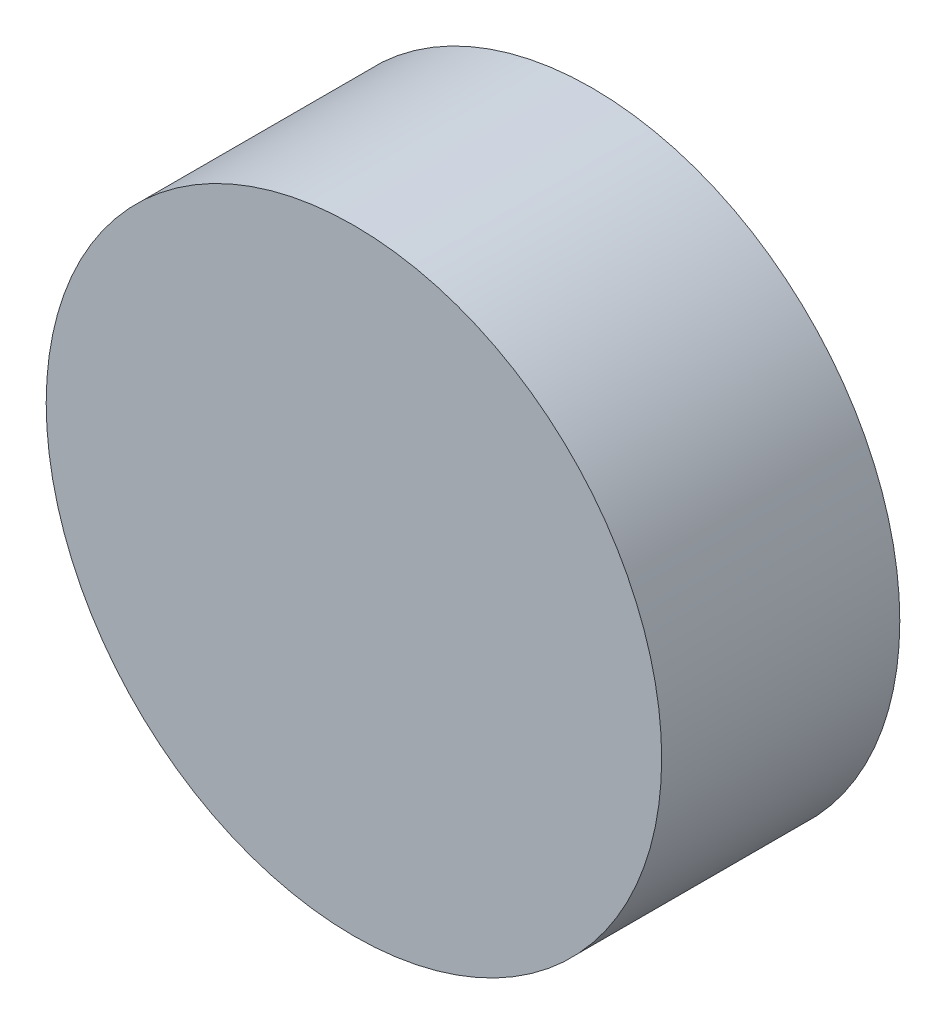
ISO-10303-21;
HEADER;
FILE_DESCRIPTION(('STEP AP214'),'2;1');
FILE_NAME('part.step','',(''),(''),'','','');
FILE_SCHEMA(('AUTOMOTIVE_DESIGN { 1 0 10303 214 1 1 1 1 }'));
ENDSEC;
DATA;
#1=APPLICATION_CONTEXT('core data for automotive mechanical design processes');
#2=APPLICATION_PROTOCOL_DEFINITION('international standard','automotive_design',2000,#1);
#3=PRODUCT_CONTEXT('',#1,'mechanical');
#4=PRODUCT('Part','Part','',(#3));
#5=PRODUCT_RELATED_PRODUCT_CATEGORY('part','',(#4));
#6=PRODUCT_DEFINITION_FORMATION('','',#4);
#7=PRODUCT_DEFINITION_CONTEXT('part definition',#1,'design');
#8=PRODUCT_DEFINITION('design','',#6,#7);
#9=PRODUCT_DEFINITION_SHAPE('','',#8);
#10=(LENGTH_UNIT() NAMED_UNIT(*) SI_UNIT(.MILLI.,.METRE.));
#11=(NAMED_UNIT(*) PLANE_ANGLE_UNIT() SI_UNIT($,.RADIAN.));
#12=(NAMED_UNIT(*) SI_UNIT($,.STERADIAN.) SOLID_ANGLE_UNIT());
#13=UNCERTAINTY_MEASURE_WITH_UNIT(LENGTH_MEASURE(1.E-05),#10,'distance_accuracy_value','');
#14=(GEOMETRIC_REPRESENTATION_CONTEXT(3) GLOBAL_UNCERTAINTY_ASSIGNED_CONTEXT((#13)) GLOBAL_UNIT_ASSIGNED_CONTEXT((#10,
#11,#12)) REPRESENTATION_CONTEXT('',''));
#15=CARTESIAN_POINT('',(0.,0.,0.));
#16=DIRECTION('',(0.,0.,1.));
#17=DIRECTION('',(1.,0.,0.));
#18=AXIS2_PLACEMENT_3D('',#15,#16,#17);
#19=CARTESIAN_POINT('',(0.,0.,26.));
#20=DIRECTION('',(0.,0.,-1.));
#21=DIRECTION('',(-1.,0.,0.));
#22=AXIS2_PLACEMENT_3D('',#19,#20,#21);
#23=CYLINDRICAL_SURFACE('',#22,33.6);
#24=CARTESIAN_POINT('',(0.,0.,26.));
#25=DIRECTION('',(0.,0.,1.));
#26=DIRECTION('',(1.,0.,0.));
#27=AXIS2_PLACEMENT_3D('',#24,#25,#26);
#28=CIRCLE('',#27,33.6);
#29=CARTESIAN_POINT('',(33.6,0.,26.));
#30=VERTEX_POINT('',#29);
#31=EDGE_CURVE('E43',#30,#30,#28,.T.);
#32=ORIENTED_EDGE('',*,*,#31,.F.);
#33=EDGE_LOOP('',(#32));
#34=FACE_BOUND('',#33,.T.);
#35=CARTESIAN_POINT('',(0.,0.,0.));
#36=DIRECTION('',(0.,0.,1.));
#37=DIRECTION('',(1.,0.,0.));
#38=AXIS2_PLACEMENT_3D('',#35,#36,#37);
#39=CIRCLE('',#38,33.6);
#40=CARTESIAN_POINT('',(33.6,0.,0.));
#41=VERTEX_POINT('',#40);
#42=EDGE_CURVE('E39',#41,#41,#39,.T.);
#43=ORIENTED_EDGE('',*,*,#42,.T.);
#44=EDGE_LOOP('',(#43));
#45=FACE_BOUND('',#44,.T.);
#46=ADVANCED_FACE('F36',(#34,#45),#23,.T.);
#47=CARTESIAN_POINT('',(0.,0.,26.));
#48=DIRECTION('',(0.,0.,1.));
#49=DIRECTION('',(1.,0.,0.));
#50=AXIS2_PLACEMENT_3D('',#47,#48,#49);
#51=PLANE('',#50);
#52=ORIENTED_EDGE('',*,*,#31,.T.);
#53=EDGE_LOOP('',(#52));
#54=FACE_BOUND('',#53,.T.);
#55=ADVANCED_FACE('F60',(#54),#51,.T.);
#56=CARTESIAN_POINT('',(0.,0.,0.));
#57=DIRECTION('',(0.,0.,1.));
#58=DIRECTION('',(1.,0.,0.));
#59=AXIS2_PLACEMENT_3D('',#56,#57,#58);
#60=PLANE('',#59);
#61=CARTESIAN_POINT('',(0.,0.,0.));
#62=DIRECTION('',(0.,0.,-1.));
#63=DIRECTION('',(-1.,0.,0.));
#64=AXIS2_PLACEMENT_3D('',#61,#62,#63);
#65=CIRCLE('',#64,6.35);
#66=CARTESIAN_POINT('',(-6.35,0.,0.));
#67=VERTEX_POINT('',#66);
#68=EDGE_CURVE('E10',#67,#67,#65,.T.);
#69=ORIENTED_EDGE('',*,*,#68,.F.);
#70=EDGE_LOOP('',(#69));
#71=FACE_BOUND('',#70,.T.);
#72=ORIENTED_EDGE('',*,*,#42,.F.);
#73=EDGE_LOOP('',(#72));
#74=FACE_BOUND('',#73,.T.);
#75=ADVANCED_FACE('F57',(#71,#74),#60,.F.);
#76=CARTESIAN_POINT('',(0.,0.,-4.572));
#77=DIRECTION('',(0.,0.,1.));
#78=DIRECTION('',(1.,0.,0.));
#79=AXIS2_PLACEMENT_3D('',#76,#77,#78);
#80=CYLINDRICAL_SURFACE('',#79,6.35);
#81=CARTESIAN_POINT('',(0.,0.,-4.572));
#82=DIRECTION('',(0.,0.,-1.));
#83=DIRECTION('',(-1.,0.,0.));
#84=AXIS2_PLACEMENT_3D('',#81,#82,#83);
#85=CIRCLE('',#84,6.35);
#86=CARTESIAN_POINT('',(-6.35,0.,-4.572));
#87=VERTEX_POINT('',#86);
#88=EDGE_CURVE('E49',#87,#87,#85,.T.);
#89=ORIENTED_EDGE('',*,*,#88,.F.);
#90=EDGE_LOOP('',(#89));
#91=FACE_BOUND('',#90,.T.);
#92=ORIENTED_EDGE('',*,*,#68,.T.);
#93=EDGE_LOOP('',(#92));
#94=FACE_BOUND('',#93,.T.);
#95=ADVANCED_FACE('F59',(#91,#94),#80,.T.);
#96=CARTESIAN_POINT('',(0.,0.,-4.572));
#97=DIRECTION('',(0.,0.,-1.));
#98=DIRECTION('',(-1.,0.,0.));
#99=AXIS2_PLACEMENT_3D('',#96,#97,#98);
#100=PLANE('',#99);
#101=ORIENTED_EDGE('',*,*,#88,.T.);
#102=EDGE_LOOP('',(#101));
#103=FACE_BOUND('',#102,.T.);
#104=ADVANCED_FACE('F66',(#103),#100,.T.);
#105=CLOSED_SHELL('',(#46,#55,#75,#95,#104));
#106=MANIFOLD_SOLID_BREP('B2',#105);
#107=ADVANCED_BREP_SHAPE_REPRESENTATION('',(#18,#106),#14);
#108=SHAPE_DEFINITION_REPRESENTATION(#9,#107);
ENDSEC;
END-ISO-10303-21;
